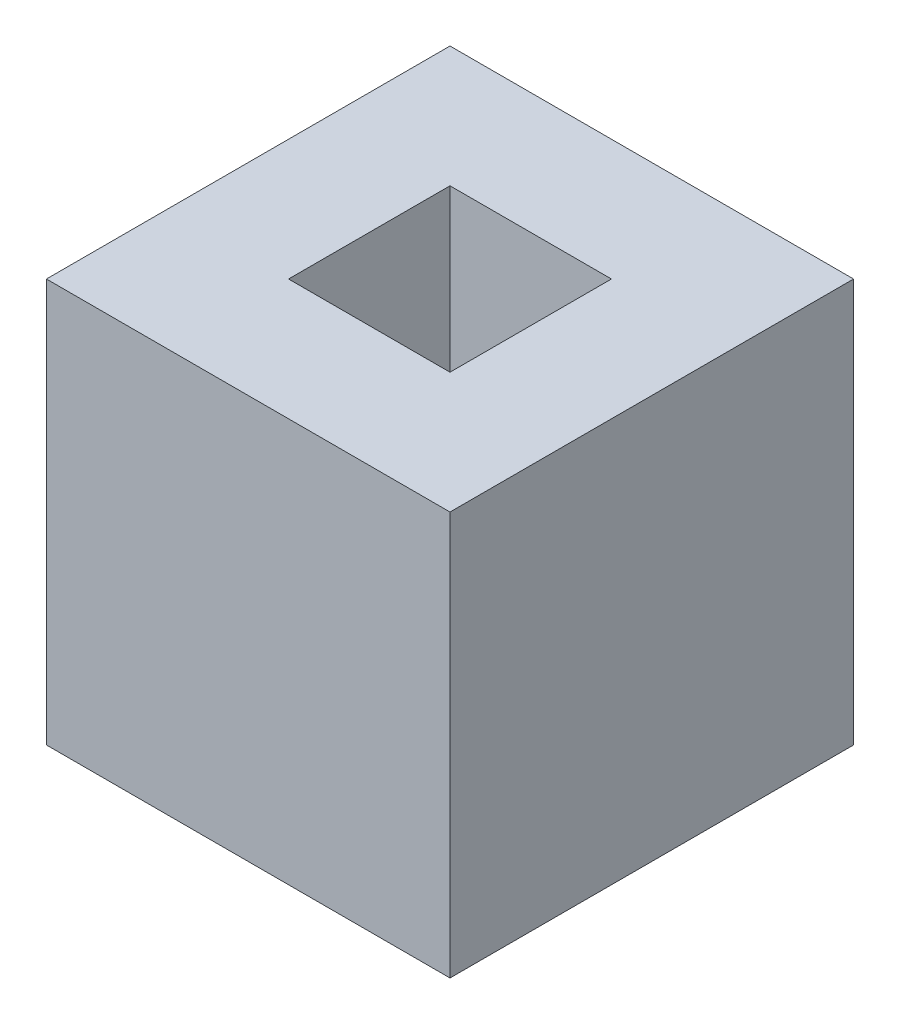
ISO-10303-21;
HEADER;
FILE_DESCRIPTION(('STEP AP214'),'2;1');
FILE_NAME('part.step','',(''),(''),'','','');
FILE_SCHEMA(('AUTOMOTIVE_DESIGN { 1 0 10303 214 1 1 1 1 }'));
ENDSEC;
DATA;
#1=APPLICATION_CONTEXT('core data for automotive mechanical design processes');
#2=APPLICATION_PROTOCOL_DEFINITION('international standard','automotive_design',2000,#1);
#3=PRODUCT_CONTEXT('',#1,'mechanical');
#4=PRODUCT('Part','Part','',(#3));
#5=PRODUCT_RELATED_PRODUCT_CATEGORY('part','',(#4));
#6=PRODUCT_DEFINITION_FORMATION('','',#4);
#7=PRODUCT_DEFINITION_CONTEXT('part definition',#1,'design');
#8=PRODUCT_DEFINITION('design','',#6,#7);
#9=PRODUCT_DEFINITION_SHAPE('','',#8);
#10=(LENGTH_UNIT() NAMED_UNIT(*) SI_UNIT(.MILLI.,.METRE.));
#11=(NAMED_UNIT(*) PLANE_ANGLE_UNIT() SI_UNIT($,.RADIAN.));
#12=(NAMED_UNIT(*) SI_UNIT($,.STERADIAN.) SOLID_ANGLE_UNIT());
#13=UNCERTAINTY_MEASURE_WITH_UNIT(LENGTH_MEASURE(1.E-05),#10,'distance_accuracy_value','');
#14=(GEOMETRIC_REPRESENTATION_CONTEXT(3) GLOBAL_UNCERTAINTY_ASSIGNED_CONTEXT((#13)) GLOBAL_UNIT_ASSIGNED_CONTEXT((#10,
#11,#12)) REPRESENTATION_CONTEXT('',''));
#15=CARTESIAN_POINT('',(0.,0.,0.));
#16=DIRECTION('',(0.,0.,1.));
#17=DIRECTION('',(1.,0.,0.));
#18=AXIS2_PLACEMENT_3D('',#15,#16,#17);
#19=CARTESIAN_POINT('',(0.,10.,-10.));
#20=DIRECTION('',(1.,0.,0.));
#21=DIRECTION('',(0.,0.,-1.));
#22=AXIS2_PLACEMENT_3D('',#19,#20,#21);
#23=PLANE('',#22);
#24=DIRECTION('',(0.,0.,1.));
#25=VECTOR('',#24,1.);
#26=CARTESIAN_POINT('',(0.,0.,-10.));
#27=LINE('',#26,#25);
#28=CARTESIAN_POINT('',(0.,0.,-10.));
#29=VERTEX_POINT('',#28);
#30=CARTESIAN_POINT('',(0.,0.,0.));
#31=VERTEX_POINT('',#30);
#32=EDGE_CURVE('E151',#29,#31,#27,.T.);
#33=ORIENTED_EDGE('',*,*,#32,.T.);
#34=DIRECTION('',(0.,-1.,0.));
#35=VECTOR('',#34,1.);
#36=CARTESIAN_POINT('',(0.,10.,0.));
#37=LINE('',#36,#35);
#38=CARTESIAN_POINT('',(0.,10.,0.));
#39=VERTEX_POINT('',#38);
#40=EDGE_CURVE('E11',#39,#31,#37,.T.);
#41=ORIENTED_EDGE('',*,*,#40,.F.);
#42=DIRECTION('',(0.,0.,1.));
#43=VECTOR('',#42,1.);
#44=CARTESIAN_POINT('',(0.,10.,-10.));
#45=LINE('',#44,#43);
#46=CARTESIAN_POINT('',(0.,10.,-10.));
#47=VERTEX_POINT('',#46);
#48=EDGE_CURVE('E157',#47,#39,#45,.T.);
#49=ORIENTED_EDGE('',*,*,#48,.F.);
#50=DIRECTION('',(0.,-1.,0.));
#51=VECTOR('',#50,1.);
#52=CARTESIAN_POINT('',(0.,10.,-10.));
#53=LINE('',#52,#51);
#54=EDGE_CURVE('E171',#47,#29,#53,.T.);
#55=ORIENTED_EDGE('',*,*,#54,.T.);
#56=EDGE_LOOP('',(#33,#41,#49,#55));
#57=FACE_BOUND('',#56,.T.);
#58=ADVANCED_FACE('F43',(#57),#23,.F.);
#59=CARTESIAN_POINT('',(0.,10.,0.));
#60=DIRECTION('',(0.,0.,-1.));
#61=DIRECTION('',(-1.,0.,0.));
#62=AXIS2_PLACEMENT_3D('',#59,#60,#61);
#63=PLANE('',#62);
#64=DIRECTION('',(1.,0.,0.));
#65=VECTOR('',#64,1.);
#66=CARTESIAN_POINT('',(0.,0.,0.));
#67=LINE('',#66,#65);
#68=CARTESIAN_POINT('',(10.,0.,0.));
#69=VERTEX_POINT('',#68);
#70=EDGE_CURVE('E175',#31,#69,#67,.T.);
#71=ORIENTED_EDGE('',*,*,#70,.T.);
#72=DIRECTION('',(0.,-1.,0.));
#73=VECTOR('',#72,1.);
#74=CARTESIAN_POINT('',(10.,10.,0.));
#75=LINE('',#74,#73);
#76=CARTESIAN_POINT('',(10.,10.,0.));
#77=VERTEX_POINT('',#76);
#78=EDGE_CURVE('E51',#77,#69,#75,.T.);
#79=ORIENTED_EDGE('',*,*,#78,.F.);
#80=DIRECTION('',(1.,0.,0.));
#81=VECTOR('',#80,1.);
#82=CARTESIAN_POINT('',(0.,10.,0.));
#83=LINE('',#82,#81);
#84=EDGE_CURVE('E161',#39,#77,#83,.T.);
#85=ORIENTED_EDGE('',*,*,#84,.F.);
#86=ORIENTED_EDGE('',*,*,#40,.T.);
#87=EDGE_LOOP('',(#71,#79,#85,#86));
#88=FACE_BOUND('',#87,.T.);
#89=ADVANCED_FACE('F209',(#88),#63,.F.);
#90=CARTESIAN_POINT('',(10.,10.,-10.));
#91=DIRECTION('',(-1.,0.,0.));
#92=DIRECTION('',(0.,0.,1.));
#93=AXIS2_PLACEMENT_3D('',#90,#91,#92);
#94=PLANE('',#93);
#95=DIRECTION('',(0.,0.,-1.));
#96=VECTOR('',#95,1.);
#97=CARTESIAN_POINT('',(10.,0.,-10.));
#98=LINE('',#97,#96);
#99=CARTESIAN_POINT('',(10.,0.,-10.));
#100=VERTEX_POINT('',#99);
#101=EDGE_CURVE('E178',#69,#100,#98,.T.);
#102=ORIENTED_EDGE('',*,*,#101,.T.);
#103=DIRECTION('',(0.,-1.,0.));
#104=VECTOR('',#103,1.);
#105=CARTESIAN_POINT('',(10.,10.,-10.));
#106=LINE('',#105,#104);
#107=CARTESIAN_POINT('',(10.,10.,-10.));
#108=VERTEX_POINT('',#107);
#109=EDGE_CURVE('E186',#108,#100,#106,.T.);
#110=ORIENTED_EDGE('',*,*,#109,.F.);
#111=DIRECTION('',(0.,0.,-1.));
#112=VECTOR('',#111,1.);
#113=CARTESIAN_POINT('',(10.,10.,-10.));
#114=LINE('',#113,#112);
#115=EDGE_CURVE('E165',#77,#108,#114,.T.);
#116=ORIENTED_EDGE('',*,*,#115,.F.);
#117=ORIENTED_EDGE('',*,*,#78,.T.);
#118=EDGE_LOOP('',(#102,#110,#116,#117));
#119=FACE_BOUND('',#118,.T.);
#120=ADVANCED_FACE('F195',(#119),#94,.F.);
#121=CARTESIAN_POINT('',(0.,10.,-10.));
#122=DIRECTION('',(0.,0.,1.));
#123=DIRECTION('',(1.,0.,0.));
#124=AXIS2_PLACEMENT_3D('',#121,#122,#123);
#125=PLANE('',#124);
#126=DIRECTION('',(-1.,0.,0.));
#127=VECTOR('',#126,1.);
#128=CARTESIAN_POINT('',(0.,0.,-10.));
#129=LINE('',#128,#127);
#130=EDGE_CURVE('E162',#100,#29,#129,.T.);
#131=ORIENTED_EDGE('',*,*,#130,.T.);
#132=ORIENTED_EDGE('',*,*,#54,.F.);
#133=DIRECTION('',(-1.,0.,0.));
#134=VECTOR('',#133,1.);
#135=CARTESIAN_POINT('',(0.,10.,-10.));
#136=LINE('',#135,#134);
#137=EDGE_CURVE('E168',#108,#47,#136,.T.);
#138=ORIENTED_EDGE('',*,*,#137,.F.);
#139=ORIENTED_EDGE('',*,*,#109,.T.);
#140=EDGE_LOOP('',(#131,#132,#138,#139));
#141=FACE_BOUND('',#140,.T.);
#142=ADVANCED_FACE('F202',(#141),#125,.F.);
#143=CARTESIAN_POINT('',(0.,10.,0.));
#144=DIRECTION('',(0.,1.,0.));
#145=DIRECTION('',(0.,0.,1.));
#146=AXIS2_PLACEMENT_3D('',#143,#144,#145);
#147=PLANE('',#146);
#148=DIRECTION('',(0.,0.,-1.));
#149=VECTOR('',#148,1.);
#150=CARTESIAN_POINT('',(7.,10.,-7.));
#151=LINE('',#150,#149);
#152=CARTESIAN_POINT('',(7.,10.,-3.));
#153=VERTEX_POINT('',#152);
#154=CARTESIAN_POINT('',(7.,10.,-7.));
#155=VERTEX_POINT('',#154);
#156=EDGE_CURVE('E58',#153,#155,#151,.T.);
#157=ORIENTED_EDGE('',*,*,#156,.F.);
#158=DIRECTION('',(1.,0.,0.));
#159=VECTOR('',#158,1.);
#160=CARTESIAN_POINT('',(7.,10.,-3.));
#161=LINE('',#160,#159);
#162=CARTESIAN_POINT('',(3.,10.,-3.));
#163=VERTEX_POINT('',#162);
#164=EDGE_CURVE('E129',#163,#153,#161,.T.);
#165=ORIENTED_EDGE('',*,*,#164,.F.);
#166=DIRECTION('',(0.,0.,1.));
#167=VECTOR('',#166,1.);
#168=CARTESIAN_POINT('',(3.,10.,-7.));
#169=LINE('',#168,#167);
#170=CARTESIAN_POINT('',(3.,10.,-7.));
#171=VERTEX_POINT('',#170);
#172=EDGE_CURVE('E133',#171,#163,#169,.T.);
#173=ORIENTED_EDGE('',*,*,#172,.F.);
#174=DIRECTION('',(-1.,0.,0.));
#175=VECTOR('',#174,1.);
#176=CARTESIAN_POINT('',(7.,10.,-7.));
#177=LINE('',#176,#175);
#178=EDGE_CURVE('E142',#155,#171,#177,.T.);
#179=ORIENTED_EDGE('',*,*,#178,.F.);
#180=EDGE_LOOP('',(#157,#165,#173,#179));
#181=FACE_BOUND('',#180,.T.);
#182=ORIENTED_EDGE('',*,*,#48,.T.);
#183=ORIENTED_EDGE('',*,*,#84,.T.);
#184=ORIENTED_EDGE('',*,*,#115,.T.);
#185=ORIENTED_EDGE('',*,*,#137,.T.);
#186=EDGE_LOOP('',(#182,#183,#184,#185));
#187=FACE_BOUND('',#186,.T.);
#188=ADVANCED_FACE('F208',(#181,#187),#147,.T.);
#189=CARTESIAN_POINT('',(0.,0.,0.));
#190=DIRECTION('',(0.,1.,0.));
#191=DIRECTION('',(0.,0.,1.));
#192=AXIS2_PLACEMENT_3D('',#189,#190,#191);
#193=PLANE('',#192);
#194=DIRECTION('',(1.,0.,0.));
#195=VECTOR('',#194,1.);
#196=CARTESIAN_POINT('',(7.,0.,-3.));
#197=LINE('',#196,#195);
#198=CARTESIAN_POINT('',(3.,0.,-3.));
#199=VERTEX_POINT('',#198);
#200=CARTESIAN_POINT('',(7.,0.,-3.));
#201=VERTEX_POINT('',#200);
#202=EDGE_CURVE('E117',#199,#201,#197,.T.);
#203=ORIENTED_EDGE('',*,*,#202,.T.);
#204=DIRECTION('',(0.,0.,-1.));
#205=VECTOR('',#204,1.);
#206=CARTESIAN_POINT('',(7.,0.,-7.));
#207=LINE('',#206,#205);
#208=CARTESIAN_POINT('',(7.,0.,-7.));
#209=VERTEX_POINT('',#208);
#210=EDGE_CURVE('E110',#201,#209,#207,.T.);
#211=ORIENTED_EDGE('',*,*,#210,.T.);
#212=DIRECTION('',(-1.,0.,0.));
#213=VECTOR('',#212,1.);
#214=CARTESIAN_POINT('',(7.,0.,-7.));
#215=LINE('',#214,#213);
#216=CARTESIAN_POINT('',(3.,0.,-7.));
#217=VERTEX_POINT('',#216);
#218=EDGE_CURVE('E120',#209,#217,#215,.T.);
#219=ORIENTED_EDGE('',*,*,#218,.T.);
#220=DIRECTION('',(0.,0.,1.));
#221=VECTOR('',#220,1.);
#222=CARTESIAN_POINT('',(3.,0.,-7.));
#223=LINE('',#222,#221);
#224=EDGE_CURVE('E66',#217,#199,#223,.T.);
#225=ORIENTED_EDGE('',*,*,#224,.T.);
#226=EDGE_LOOP('',(#203,#211,#219,#225));
#227=FACE_BOUND('',#226,.T.);
#228=ORIENTED_EDGE('',*,*,#32,.F.);
#229=ORIENTED_EDGE('',*,*,#130,.F.);
#230=ORIENTED_EDGE('',*,*,#101,.F.);
#231=ORIENTED_EDGE('',*,*,#70,.F.);
#232=EDGE_LOOP('',(#228,#229,#230,#231));
#233=FACE_BOUND('',#232,.T.);
#234=ADVANCED_FACE('F125',(#227,#233),#193,.F.);
#235=CARTESIAN_POINT('',(7.,0.,-7.));
#236=DIRECTION('',(1.,0.,0.));
#237=DIRECTION('',(0.,0.,-1.));
#238=AXIS2_PLACEMENT_3D('',#235,#236,#237);
#239=PLANE('',#238);
#240=ORIENTED_EDGE('',*,*,#156,.T.);
#241=DIRECTION('',(0.,1.,0.));
#242=VECTOR('',#241,1.);
#243=CARTESIAN_POINT('',(7.,0.,-7.));
#244=LINE('',#243,#242);
#245=EDGE_CURVE('E106',#209,#155,#244,.T.);
#246=ORIENTED_EDGE('',*,*,#245,.F.);
#247=ORIENTED_EDGE('',*,*,#210,.F.);
#248=DIRECTION('',(0.,1.,0.));
#249=VECTOR('',#248,1.);
#250=CARTESIAN_POINT('',(7.,0.,-3.));
#251=LINE('',#250,#249);
#252=EDGE_CURVE('E148',#201,#153,#251,.T.);
#253=ORIENTED_EDGE('',*,*,#252,.T.);
#254=EDGE_LOOP('',(#240,#246,#247,#253));
#255=FACE_BOUND('',#254,.T.);
#256=ADVANCED_FACE('F108',(#255),#239,.F.);
#257=CARTESIAN_POINT('',(7.,0.,-3.));
#258=DIRECTION('',(0.,0.,1.));
#259=DIRECTION('',(1.,0.,0.));
#260=AXIS2_PLACEMENT_3D('',#257,#258,#259);
#261=PLANE('',#260);
#262=ORIENTED_EDGE('',*,*,#164,.T.);
#263=ORIENTED_EDGE('',*,*,#252,.F.);
#264=ORIENTED_EDGE('',*,*,#202,.F.);
#265=DIRECTION('',(0.,1.,0.));
#266=VECTOR('',#265,1.);
#267=CARTESIAN_POINT('',(3.,0.,-3.));
#268=LINE('',#267,#266);
#269=EDGE_CURVE('E152',#199,#163,#268,.T.);
#270=ORIENTED_EDGE('',*,*,#269,.T.);
#271=EDGE_LOOP('',(#262,#263,#264,#270));
#272=FACE_BOUND('',#271,.T.);
#273=ADVANCED_FACE('F226',(#272),#261,.F.);
#274=CARTESIAN_POINT('',(3.,0.,-7.));
#275=DIRECTION('',(-1.,0.,0.));
#276=DIRECTION('',(0.,0.,1.));
#277=AXIS2_PLACEMENT_3D('',#274,#275,#276);
#278=PLANE('',#277);
#279=ORIENTED_EDGE('',*,*,#172,.T.);
#280=ORIENTED_EDGE('',*,*,#269,.F.);
#281=ORIENTED_EDGE('',*,*,#224,.F.);
#282=DIRECTION('',(0.,1.,0.));
#283=VECTOR('',#282,1.);
#284=CARTESIAN_POINT('',(3.,0.,-7.));
#285=LINE('',#284,#283);
#286=EDGE_CURVE('E116',#217,#171,#285,.T.);
#287=ORIENTED_EDGE('',*,*,#286,.T.);
#288=EDGE_LOOP('',(#279,#280,#281,#287));
#289=FACE_BOUND('',#288,.T.);
#290=ADVANCED_FACE('F229',(#289),#278,.F.);
#291=CARTESIAN_POINT('',(7.,0.,-7.));
#292=DIRECTION('',(0.,0.,-1.));
#293=DIRECTION('',(-1.,0.,0.));
#294=AXIS2_PLACEMENT_3D('',#291,#292,#293);
#295=PLANE('',#294);
#296=ORIENTED_EDGE('',*,*,#178,.T.);
#297=ORIENTED_EDGE('',*,*,#286,.F.);
#298=ORIENTED_EDGE('',*,*,#218,.F.);
#299=ORIENTED_EDGE('',*,*,#245,.T.);
#300=EDGE_LOOP('',(#296,#297,#298,#299));
#301=FACE_BOUND('',#300,.T.);
#302=ADVANCED_FACE('F121',(#301),#295,.F.);
#303=CLOSED_SHELL('',(#58,#89,#120,#142,#188,#234,#256,#273,#290,#302));
#304=MANIFOLD_SOLID_BREP('B2',#303);
#305=ADVANCED_BREP_SHAPE_REPRESENTATION('',(#18,#304),#14);
#306=SHAPE_DEFINITION_REPRESENTATION(#9,#305);
ENDSEC;
END-ISO-10303-21;
